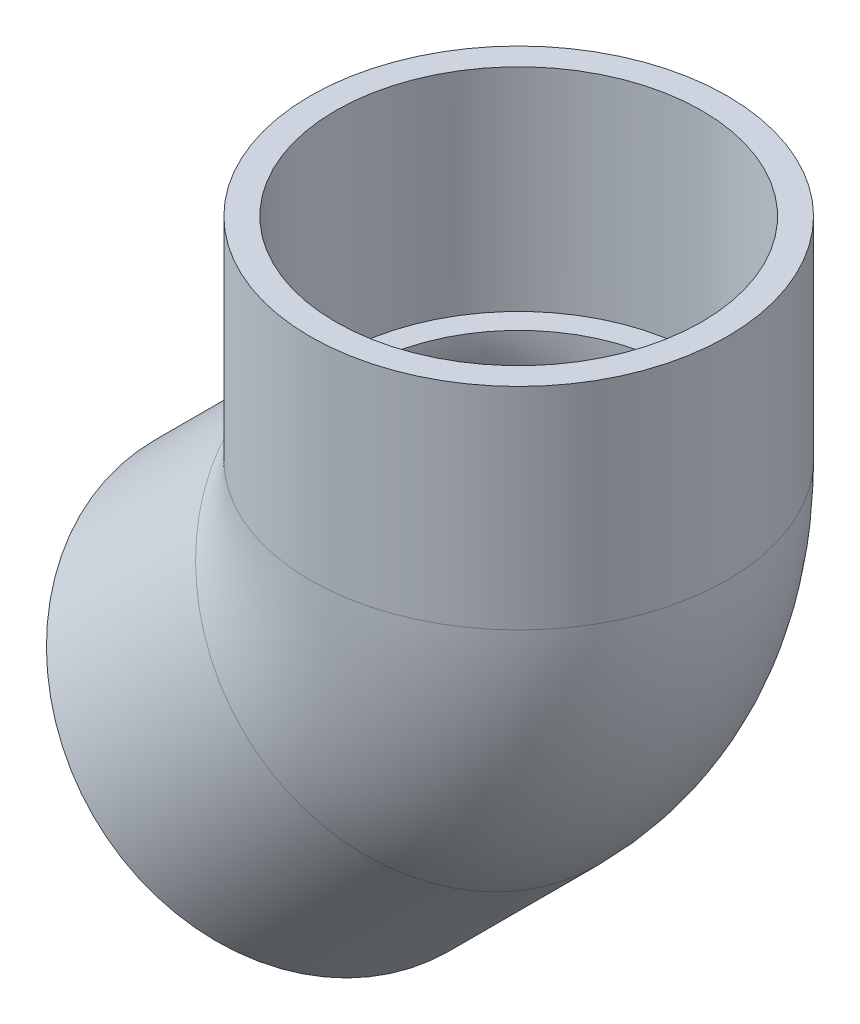
ISO-10303-21;
HEADER;
FILE_DESCRIPTION(('STEP AP214'),'2;1');
FILE_NAME('part.step','',(''),(''),'','','');
FILE_SCHEMA(('AUTOMOTIVE_DESIGN { 1 0 10303 214 1 1 1 1 }'));
ENDSEC;
DATA;
#1=APPLICATION_CONTEXT('core data for automotive mechanical design processes');
#2=APPLICATION_PROTOCOL_DEFINITION('international standard','automotive_design',2000,#1);
#3=PRODUCT_CONTEXT('',#1,'mechanical');
#4=PRODUCT('Part','Part','',(#3));
#5=PRODUCT_RELATED_PRODUCT_CATEGORY('part','',(#4));
#6=PRODUCT_DEFINITION_FORMATION('','',#4);
#7=PRODUCT_DEFINITION_CONTEXT('part definition',#1,'design');
#8=PRODUCT_DEFINITION('design','',#6,#7);
#9=PRODUCT_DEFINITION_SHAPE('','',#8);
#10=(LENGTH_UNIT() NAMED_UNIT(*) SI_UNIT(.MILLI.,.METRE.));
#11=(NAMED_UNIT(*) PLANE_ANGLE_UNIT() SI_UNIT($,.RADIAN.));
#12=(NAMED_UNIT(*) SI_UNIT($,.STERADIAN.) SOLID_ANGLE_UNIT());
#13=UNCERTAINTY_MEASURE_WITH_UNIT(LENGTH_MEASURE(1.E-05),#10,'distance_accuracy_value','');
#14=(GEOMETRIC_REPRESENTATION_CONTEXT(3) GLOBAL_UNCERTAINTY_ASSIGNED_CONTEXT((#13)) GLOBAL_UNIT_ASSIGNED_CONTEXT((#10,
#11,#12)) REPRESENTATION_CONTEXT('',''));
#15=CARTESIAN_POINT('',(0.,0.,0.));
#16=DIRECTION('',(0.,0.,1.));
#17=DIRECTION('',(1.,0.,0.));
#18=AXIS2_PLACEMENT_3D('',#15,#16,#17);
#19=CARTESIAN_POINT('',(-11.50595315512,-60.3360958134333,0.));
#20=DIRECTION('',(-0.707106781186549,-0.707106781186546,0.));
#21=DIRECTION('',(0.707106781186546,-0.707106781186549,0.));
#22=AXIS2_PLACEMENT_3D('',#19,#20,#21);
#23=PLANE('',#22);
#24=CARTESIAN_POINT('',(-35.9210244842767,-35.9210244842766,0.));
#25=DIRECTION('',(-0.707106781186549,-0.707106781186546,0.));
#26=DIRECTION('',(0.707106781186546,-0.707106781186549,0.));
#27=AXIS2_PLACEMENT_3D('',#24,#25,#26);
#28=CIRCLE('',#27,34.528125);
#29=CARTESIAN_POINT('',(-11.50595315512,-60.3360958134333,0.));
#30=VERTEX_POINT('',#29);
#31=EDGE_CURVE('E56',#30,#30,#28,.T.);
#32=ORIENTED_EDGE('',*,*,#31,.T.);
#33=EDGE_LOOP('',(#32));
#34=FACE_BOUND('',#33,.T.);
#35=CARTESIAN_POINT('',(-35.9210244842767,-35.9210244842766,0.));
#36=DIRECTION('',(-0.707106781186549,-0.707106781186546,0.));
#37=DIRECTION('',(0.707106781186546,-0.707106781186549,0.));
#38=AXIS2_PLACEMENT_3D('',#35,#36,#37);
#39=CIRCLE('',#38,30.3149);
#40=CARTESIAN_POINT('',(-14.4851531232846,-57.3568958452686,0.));
#41=VERTEX_POINT('',#40);
#42=EDGE_CURVE('E43',#41,#41,#39,.T.);
#43=ORIENTED_EDGE('',*,*,#42,.F.);
#44=EDGE_LOOP('',(#43));
#45=FACE_BOUND('',#44,.T.);
#46=ADVANCED_FACE('F37',(#34,#45),#23,.T.);
#47=CARTESIAN_POINT('',(-11.2253201513365,-11.2253201513364,0.));
#48=DIRECTION('',(-0.707106781186549,-0.707106781186546,0.));
#49=DIRECTION('',(0.707106781186546,-0.707106781186549,0.));
#50=AXIS2_PLACEMENT_3D('',#47,#48,#49);
#51=CONICAL_SURFACE('',#50,30.0863,0.00654536107227494);
#52=ORIENTED_EDGE('',*,*,#42,.T.);
#53=EDGE_LOOP('',(#52));
#54=FACE_BOUND('',#53,.T.);
#55=CARTESIAN_POINT('',(-11.2253201513365,-11.2253201513364,0.));
#56=DIRECTION('',(-0.707106781186549,-0.707106781186546,0.));
#57=DIRECTION('',(0.707106781186546,-0.707106781186549,0.));
#58=AXIS2_PLACEMENT_3D('',#55,#56,#57);
#59=CIRCLE('',#58,30.0863);
#60=CARTESIAN_POINT('',(10.0489065994763,-32.4995469021493,0.));
#61=VERTEX_POINT('',#60);
#62=EDGE_CURVE('E47',#61,#61,#59,.T.);
#63=ORIENTED_EDGE('',*,*,#62,.F.);
#64=EDGE_LOOP('',(#63));
#65=FACE_BOUND('',#64,.T.);
#66=ADVANCED_FACE('F88',(#54,#65),#51,.F.);
#67=CARTESIAN_POINT('',(-35.9210244842767,-35.9210244842766,0.));
#68=DIRECTION('',(-0.707106781186549,-0.707106781186546,0.));
#69=DIRECTION('',(0.707106781186546,-0.707106781186549,0.));
#70=AXIS2_PLACEMENT_3D('',#67,#68,#69);
#71=CYLINDRICAL_SURFACE('',#70,34.528125);
#72=CARTESIAN_POINT('',(-11.2253201513365,-11.2253201513364,0.));
#73=DIRECTION('',(-0.707106781186549,-0.707106781186546,0.));
#74=DIRECTION('',(0.707106781186546,-0.707106781186549,0.));
#75=AXIS2_PLACEMENT_3D('',#72,#73,#74);
#76=CIRCLE('',#75,34.528125);
#77=CARTESIAN_POINT('',(13.1897511778203,-35.6403914804932,0.));
#78=VERTEX_POINT('',#77);
#79=EDGE_CURVE('E51',#78,#78,#76,.T.);
#80=ORIENTED_EDGE('',*,*,#79,.T.);
#81=EDGE_LOOP('',(#80));
#82=FACE_BOUND('',#81,.T.);
#83=ORIENTED_EDGE('',*,*,#31,.F.);
#84=EDGE_LOOP('',(#83));
#85=FACE_BOUND('',#84,.T.);
#86=ADVANCED_FACE('F93',(#82,#85),#71,.T.);
#87=CARTESIAN_POINT('',(-38.3256403026728,15.875,0.));
#88=DIRECTION('',(0.,0.,-1.));
#89=DIRECTION('',(-1.,0.,0.));
#90=AXIS2_PLACEMENT_3D('',#87,#88,#89);
#91=TOROIDAL_SURFACE('',#90,38.3256403026728,26.2509);
#92=CARTESIAN_POINT('',(0.,15.875,0.));
#93=DIRECTION('',(0.,1.,0.));
#94=DIRECTION('',(-1.,0.,0.));
#95=AXIS2_PLACEMENT_3D('',#92,#93,#94);
#96=CIRCLE('',#95,26.2509);
#97=CARTESIAN_POINT('',(26.2509,15.875,0.));
#98=VERTEX_POINT('',#97);
#99=EDGE_CURVE('E62',#98,#98,#96,.T.);
#100=CARTESIAN_POINT('',(-11.2253201513365,-11.2253201513364,0.));
#101=DIRECTION('',(0.707106781186549,0.707106781186546,0.));
#102=DIRECTION('',(-0.707106781186546,0.707106781186549,0.));
#103=AXIS2_PLACEMENT_3D('',#100,#101,#102);
#104=CIRCLE('',#103,26.2509);
#105=CARTESIAN_POINT('',(7.33686925091345,-29.7875095535864,0.));
#106=VERTEX_POINT('',#105);
#107=EDGE_CURVE('E65',#106,#106,#104,.T.);
#108=CARTESIAN_POINT('',(-38.3256403026728,15.875,0.));
#109=DIRECTION('',(0.,0.,-1.));
#110=DIRECTION('',(-1.,0.,0.));
#111=AXIS2_PLACEMENT_3D('',#108,#109,#110);
#112=CIRCLE('',#111,64.5765403026728);
#113=EDGE_CURVE('',#98,#106,#112,.T.);
#114=ORIENTED_EDGE('',*,*,#99,.T.);
#115=ORIENTED_EDGE('',*,*,#107,.F.);
#116=ORIENTED_EDGE('',*,*,#113,.T.);
#117=ORIENTED_EDGE('',*,*,#113,.F.);
#118=EDGE_LOOP('',(#114,#116,#115,#117));
#119=FACE_BOUND('',#118,.T.);
#120=ADVANCED_FACE('F98',(#119),#91,.F.);
#121=CARTESIAN_POINT('',(-38.3256403026728,15.875,0.));
#122=DIRECTION('',(0.,0.,-1.));
#123=DIRECTION('',(-1.,0.,0.));
#124=AXIS2_PLACEMENT_3D('',#121,#122,#123);
#125=TOROIDAL_SURFACE('',#124,38.3256403026728,34.528125);
#126=CARTESIAN_POINT('',(0.,15.875,0.));
#127=DIRECTION('',(0.,1.,0.));
#128=DIRECTION('',(-1.,0.,0.));
#129=AXIS2_PLACEMENT_3D('',#126,#127,#128);
#130=CIRCLE('',#129,34.528125);
#131=CARTESIAN_POINT('',(34.528125,15.875,0.));
#132=VERTEX_POINT('',#131);
#133=EDGE_CURVE('E59',#132,#132,#130,.T.);
#134=CARTESIAN_POINT('',(-38.3256403026728,15.875,0.));
#135=DIRECTION('',(0.,0.,-1.));
#136=DIRECTION('',(-1.,0.,0.));
#137=AXIS2_PLACEMENT_3D('',#134,#135,#136);
#138=CIRCLE('',#137,72.8537653026728);
#139=EDGE_CURVE('',#132,#78,#138,.T.);
#140=ORIENTED_EDGE('',*,*,#133,.F.);
#141=ORIENTED_EDGE('',*,*,#79,.F.);
#142=ORIENTED_EDGE('',*,*,#139,.T.);
#143=ORIENTED_EDGE('',*,*,#139,.F.);
#144=EDGE_LOOP('',(#140,#142,#141,#143));
#145=FACE_BOUND('',#144,.T.);
#146=ADVANCED_FACE('F104',(#145),#125,.T.);
#147=CARTESIAN_POINT('',(0.,15.875,0.));
#148=DIRECTION('',(0.,1.,0.));
#149=DIRECTION('',(-1.,0.,0.));
#150=AXIS2_PLACEMENT_3D('',#147,#148,#149);
#151=PLANE('',#150);
#152=CARTESIAN_POINT('',(0.,15.875,0.));
#153=DIRECTION('',(0.,1.,0.));
#154=DIRECTION('',(-1.,0.,0.));
#155=AXIS2_PLACEMENT_3D('',#152,#153,#154);
#156=CIRCLE('',#155,30.0863);
#157=CARTESIAN_POINT('',(-30.0863,15.875,0.));
#158=VERTEX_POINT('',#157);
#159=EDGE_CURVE('E10',#158,#158,#156,.F.);
#160=ORIENTED_EDGE('',*,*,#159,.F.);
#161=EDGE_LOOP('',(#160));
#162=FACE_BOUND('',#161,.T.);
#163=ORIENTED_EDGE('',*,*,#99,.F.);
#164=EDGE_LOOP('',(#163));
#165=FACE_BOUND('',#164,.T.);
#166=ADVANCED_FACE('F109',(#162,#165),#151,.T.);
#167=CARTESIAN_POINT('',(-11.2253201513365,-11.2253201513364,0.));
#168=DIRECTION('',(0.707106781186549,0.707106781186546,0.));
#169=DIRECTION('',(-0.707106781186546,0.707106781186549,0.));
#170=AXIS2_PLACEMENT_3D('',#167,#168,#169);
#171=PLANE('',#170);
#172=ORIENTED_EDGE('',*,*,#62,.T.);
#173=EDGE_LOOP('',(#172));
#174=FACE_BOUND('',#173,.T.);
#175=ORIENTED_EDGE('',*,*,#107,.T.);
#176=EDGE_LOOP('',(#175));
#177=FACE_BOUND('',#176,.T.);
#178=ADVANCED_FACE('F114',(#174,#177),#171,.F.);
#179=CARTESIAN_POINT('',(34.528125,50.8,0.));
#180=DIRECTION('',(0.,1.,0.));
#181=DIRECTION('',(0.,0.,1.));
#182=AXIS2_PLACEMENT_3D('',#179,#180,#181);
#183=PLANE('',#182);
#184=CARTESIAN_POINT('',(0.,50.8,0.));
#185=DIRECTION('',(0.,-1.,0.));
#186=DIRECTION('',(0.,0.,-1.));
#187=AXIS2_PLACEMENT_3D('',#184,#185,#186);
#188=CIRCLE('',#187,30.3149);
#189=CARTESIAN_POINT('',(0.,50.8,-30.3149));
#190=VERTEX_POINT('',#189);
#191=EDGE_CURVE('E71',#190,#190,#188,.T.);
#192=ORIENTED_EDGE('',*,*,#191,.T.);
#193=EDGE_LOOP('',(#192));
#194=FACE_BOUND('',#193,.T.);
#195=CARTESIAN_POINT('',(0.,50.8,0.));
#196=DIRECTION('',(0.,-1.,0.));
#197=DIRECTION('',(0.,0.,-1.));
#198=AXIS2_PLACEMENT_3D('',#195,#196,#197);
#199=CIRCLE('',#198,34.528125);
#200=CARTESIAN_POINT('',(0.,50.8,-34.528125));
#201=VERTEX_POINT('',#200);
#202=EDGE_CURVE('E68',#201,#201,#199,.T.);
#203=ORIENTED_EDGE('',*,*,#202,.F.);
#204=EDGE_LOOP('',(#203));
#205=FACE_BOUND('',#204,.T.);
#206=ADVANCED_FACE('F75',(#194,#205),#183,.T.);
#207=CARTESIAN_POINT('',(0.,0.,0.));
#208=DIRECTION('',(0.,-1.,0.));
#209=DIRECTION('',(0.,0.,-1.));
#210=AXIS2_PLACEMENT_3D('',#207,#208,#209);
#211=CYLINDRICAL_SURFACE('',#210,34.528125);
#212=ORIENTED_EDGE('',*,*,#202,.T.);
#213=EDGE_LOOP('',(#212));
#214=FACE_BOUND('',#213,.T.);
#215=ORIENTED_EDGE('',*,*,#133,.T.);
#216=EDGE_LOOP('',(#215));
#217=FACE_BOUND('',#216,.T.);
#218=ADVANCED_FACE('F80',(#214,#217),#211,.T.);
#219=CARTESIAN_POINT('',(0.,50.8,0.));
#220=DIRECTION('',(0.,1.,0.));
#221=DIRECTION('',(0.,0.,1.));
#222=AXIS2_PLACEMENT_3D('',#219,#220,#221);
#223=CONICAL_SURFACE('',#222,30.3149,0.00654536107227504);
#224=ORIENTED_EDGE('',*,*,#159,.T.);
#225=EDGE_LOOP('',(#224));
#226=FACE_BOUND('',#225,.T.);
#227=ORIENTED_EDGE('',*,*,#191,.F.);
#228=EDGE_LOOP('',(#227));
#229=FACE_BOUND('',#228,.T.);
#230=ADVANCED_FACE('F78',(#226,#229),#223,.F.);
#231=CLOSED_SHELL('',(#46,#66,#86,#120,#146,#166,#178,#206,#218,#230));
#232=MANIFOLD_SOLID_BREP('B2',#231);
#233=ADVANCED_BREP_SHAPE_REPRESENTATION('',(#18,#232),#14);
#234=SHAPE_DEFINITION_REPRESENTATION(#9,#233);
ENDSEC;
END-ISO-10303-21;
